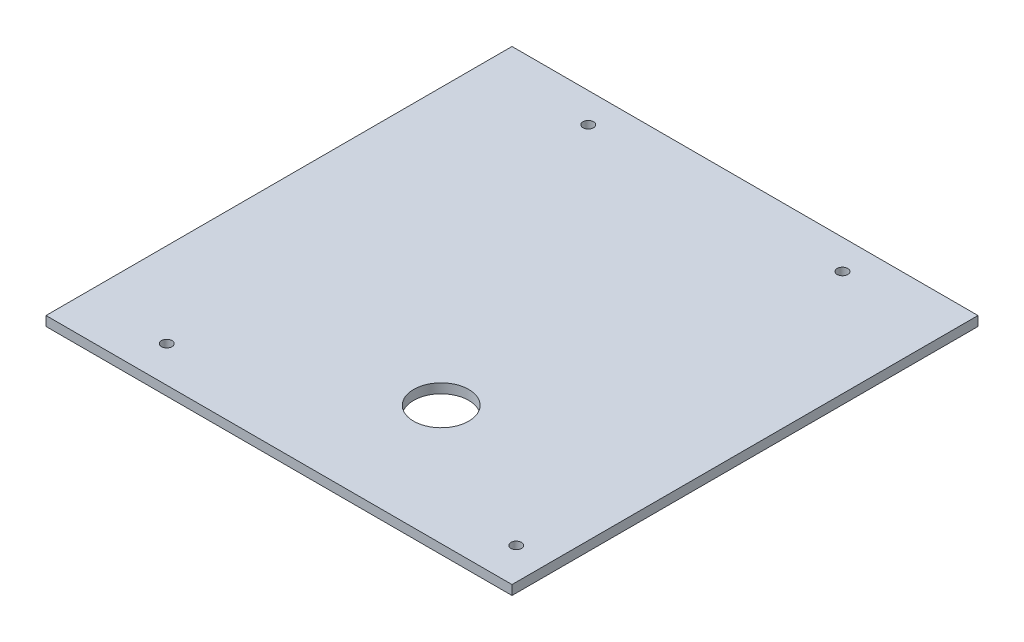
ISO-10303-21;
HEADER;
FILE_DESCRIPTION(('STEP AP214'),'2;1');
FILE_NAME('part.step','',(''),(''),'','','');
FILE_SCHEMA(('AUTOMOTIVE_DESIGN { 1 0 10303 214 1 1 1 1 }'));
ENDSEC;
DATA;
#1=APPLICATION_CONTEXT('core data for automotive mechanical design processes');
#2=APPLICATION_PROTOCOL_DEFINITION('international standard','automotive_design',2000,#1);
#3=PRODUCT_CONTEXT('',#1,'mechanical');
#4=PRODUCT('Part','Part','',(#3));
#5=PRODUCT_RELATED_PRODUCT_CATEGORY('part','',(#4));
#6=PRODUCT_DEFINITION_FORMATION('','',#4);
#7=PRODUCT_DEFINITION_CONTEXT('part definition',#1,'design');
#8=PRODUCT_DEFINITION('design','',#6,#7);
#9=PRODUCT_DEFINITION_SHAPE('','',#8);
#10=(LENGTH_UNIT() NAMED_UNIT(*) SI_UNIT(.MILLI.,.METRE.));
#11=(NAMED_UNIT(*) PLANE_ANGLE_UNIT() SI_UNIT($,.RADIAN.));
#12=(NAMED_UNIT(*) SI_UNIT($,.STERADIAN.) SOLID_ANGLE_UNIT());
#13=UNCERTAINTY_MEASURE_WITH_UNIT(LENGTH_MEASURE(1.E-05),#10,'distance_accuracy_value','');
#14=(GEOMETRIC_REPRESENTATION_CONTEXT(3) GLOBAL_UNCERTAINTY_ASSIGNED_CONTEXT((#13)) GLOBAL_UNIT_ASSIGNED_CONTEXT((#10,
#11,#12)) REPRESENTATION_CONTEXT('',''));
#15=CARTESIAN_POINT('',(0.,0.,0.));
#16=DIRECTION('',(0.,0.,1.));
#17=DIRECTION('',(1.,0.,0.));
#18=AXIS2_PLACEMENT_3D('',#15,#16,#17);
#19=CARTESIAN_POINT('',(110.,4.5,110.));
#20=DIRECTION('',(-1.,0.,0.));
#21=DIRECTION('',(0.,0.,1.));
#22=AXIS2_PLACEMENT_3D('',#19,#20,#21);
#23=PLANE('',#22);
#24=DIRECTION('',(0.,0.,-1.));
#25=VECTOR('',#24,1.);
#26=CARTESIAN_POINT('',(110.,0.,110.));
#27=LINE('',#26,#25);
#28=CARTESIAN_POINT('',(110.,0.,110.));
#29=VERTEX_POINT('',#28);
#30=CARTESIAN_POINT('',(110.,0.,-110.));
#31=VERTEX_POINT('',#30);
#32=EDGE_CURVE('E96',#29,#31,#27,.T.);
#33=ORIENTED_EDGE('',*,*,#32,.T.);
#34=DIRECTION('',(0.,-1.,0.));
#35=VECTOR('',#34,1.);
#36=CARTESIAN_POINT('',(110.,4.5,-110.));
#37=LINE('',#36,#35);
#38=CARTESIAN_POINT('',(110.,4.5,-110.));
#39=VERTEX_POINT('',#38);
#40=EDGE_CURVE('E11',#39,#31,#37,.T.);
#41=ORIENTED_EDGE('',*,*,#40,.F.);
#42=DIRECTION('',(0.,0.,-1.));
#43=VECTOR('',#42,1.);
#44=CARTESIAN_POINT('',(110.,4.5,110.));
#45=LINE('',#44,#43);
#46=CARTESIAN_POINT('',(110.,4.5,110.));
#47=VERTEX_POINT('',#46);
#48=EDGE_CURVE('E84',#47,#39,#45,.T.);
#49=ORIENTED_EDGE('',*,*,#48,.F.);
#50=DIRECTION('',(0.,-1.,0.));
#51=VECTOR('',#50,1.);
#52=CARTESIAN_POINT('',(110.,4.5,110.));
#53=LINE('',#52,#51);
#54=EDGE_CURVE('E92',#47,#29,#53,.T.);
#55=ORIENTED_EDGE('',*,*,#54,.T.);
#56=EDGE_LOOP('',(#33,#41,#49,#55));
#57=FACE_BOUND('',#56,.T.);
#58=ADVANCED_FACE('F33',(#57),#23,.F.);
#59=CARTESIAN_POINT('',(-110.,4.5,-110.));
#60=DIRECTION('',(0.,0.,1.));
#61=DIRECTION('',(1.,0.,0.));
#62=AXIS2_PLACEMENT_3D('',#59,#60,#61);
#63=PLANE('',#62);
#64=DIRECTION('',(-1.,0.,0.));
#65=VECTOR('',#64,1.);
#66=CARTESIAN_POINT('',(-110.,0.,-110.));
#67=LINE('',#66,#65);
#68=CARTESIAN_POINT('',(-110.,0.,-110.));
#69=VERTEX_POINT('',#68);
#70=EDGE_CURVE('E88',#31,#69,#67,.T.);
#71=ORIENTED_EDGE('',*,*,#70,.T.);
#72=DIRECTION('',(0.,-1.,0.));
#73=VECTOR('',#72,1.);
#74=CARTESIAN_POINT('',(-110.,4.5,-110.));
#75=LINE('',#74,#73);
#76=CARTESIAN_POINT('',(-110.,4.5,-110.));
#77=VERTEX_POINT('',#76);
#78=EDGE_CURVE('E41',#77,#69,#75,.T.);
#79=ORIENTED_EDGE('',*,*,#78,.F.);
#80=DIRECTION('',(-1.,0.,0.));
#81=VECTOR('',#80,1.);
#82=CARTESIAN_POINT('',(-110.,4.5,-110.));
#83=LINE('',#82,#81);
#84=EDGE_CURVE('E79',#39,#77,#83,.T.);
#85=ORIENTED_EDGE('',*,*,#84,.F.);
#86=ORIENTED_EDGE('',*,*,#40,.T.);
#87=EDGE_LOOP('',(#71,#79,#85,#86));
#88=FACE_BOUND('',#87,.T.);
#89=ADVANCED_FACE('F87',(#88),#63,.F.);
#90=CARTESIAN_POINT('',(-110.,4.5,110.));
#91=DIRECTION('',(1.,0.,0.));
#92=DIRECTION('',(0.,0.,-1.));
#93=AXIS2_PLACEMENT_3D('',#90,#91,#92);
#94=PLANE('',#93);
#95=DIRECTION('',(0.,0.,1.));
#96=VECTOR('',#95,1.);
#97=CARTESIAN_POINT('',(-110.,0.,110.));
#98=LINE('',#97,#96);
#99=CARTESIAN_POINT('',(-110.,0.,110.));
#100=VERTEX_POINT('',#99);
#101=EDGE_CURVE('E66',#69,#100,#98,.T.);
#102=ORIENTED_EDGE('',*,*,#101,.T.);
#103=DIRECTION('',(0.,-1.,0.));
#104=VECTOR('',#103,1.);
#105=CARTESIAN_POINT('',(-110.,4.5,110.));
#106=LINE('',#105,#104);
#107=CARTESIAN_POINT('',(-110.,4.5,110.));
#108=VERTEX_POINT('',#107);
#109=EDGE_CURVE('E89',#108,#100,#106,.T.);
#110=ORIENTED_EDGE('',*,*,#109,.F.);
#111=DIRECTION('',(0.,0.,1.));
#112=VECTOR('',#111,1.);
#113=CARTESIAN_POINT('',(-110.,4.5,110.));
#114=LINE('',#113,#112);
#115=EDGE_CURVE('E82',#77,#108,#114,.T.);
#116=ORIENTED_EDGE('',*,*,#115,.F.);
#117=ORIENTED_EDGE('',*,*,#78,.T.);
#118=EDGE_LOOP('',(#102,#110,#116,#117));
#119=FACE_BOUND('',#118,.T.);
#120=ADVANCED_FACE('F90',(#119),#94,.F.);
#121=CARTESIAN_POINT('',(-110.,4.5,110.));
#122=DIRECTION('',(0.,0.,-1.));
#123=DIRECTION('',(-1.,0.,0.));
#124=AXIS2_PLACEMENT_3D('',#121,#122,#123);
#125=PLANE('',#124);
#126=DIRECTION('',(1.,0.,0.));
#127=VECTOR('',#126,1.);
#128=CARTESIAN_POINT('',(-110.,0.,110.));
#129=LINE('',#128,#127);
#130=EDGE_CURVE('E72',#100,#29,#129,.T.);
#131=ORIENTED_EDGE('',*,*,#130,.T.);
#132=ORIENTED_EDGE('',*,*,#54,.F.);
#133=DIRECTION('',(1.,0.,0.));
#134=VECTOR('',#133,1.);
#135=CARTESIAN_POINT('',(-110.,4.5,110.));
#136=LINE('',#135,#134);
#137=EDGE_CURVE('E49',#108,#47,#136,.T.);
#138=ORIENTED_EDGE('',*,*,#137,.F.);
#139=ORIENTED_EDGE('',*,*,#109,.T.);
#140=EDGE_LOOP('',(#131,#132,#138,#139));
#141=FACE_BOUND('',#140,.T.);
#142=ADVANCED_FACE('F104',(#141),#125,.F.);
#143=CARTESIAN_POINT('',(0.,4.5,0.));
#144=DIRECTION('',(0.,-1.,0.));
#145=DIRECTION('',(0.,0.,-1.));
#146=AXIS2_PLACEMENT_3D('',#143,#144,#145);
#147=PLANE('',#146);
#148=CARTESIAN_POINT('',(-60.,4.5,-95.9999999999999));
#149=DIRECTION('',(0.,-1.,0.));
#150=DIRECTION('',(0.,0.,-1.));
#151=AXIS2_PLACEMENT_3D('',#148,#149,#150);
#152=CIRCLE('',#151,2.5);
#153=CARTESIAN_POINT('',(-60.,4.5,-98.4999999999999));
#154=VERTEX_POINT('',#153);
#155=EDGE_CURVE('E133',#154,#154,#152,.F.);
#156=ORIENTED_EDGE('',*,*,#155,.F.);
#157=EDGE_LOOP('',(#156));
#158=FACE_BOUND('',#157,.T.);
#159=CARTESIAN_POINT('',(60.,4.5,-95.9999999999999));
#160=DIRECTION('',(0.,-1.,0.));
#161=DIRECTION('',(0.,0.,-1.));
#162=AXIS2_PLACEMENT_3D('',#159,#160,#161);
#163=CIRCLE('',#162,2.5);
#164=CARTESIAN_POINT('',(60.,4.5,-98.4999999999999));
#165=VERTEX_POINT('',#164);
#166=EDGE_CURVE('E125',#165,#165,#163,.F.);
#167=ORIENTED_EDGE('',*,*,#166,.F.);
#168=EDGE_LOOP('',(#167));
#169=FACE_BOUND('',#168,.T.);
#170=CARTESIAN_POINT('',(-70.,4.5,93.));
#171=DIRECTION('',(0.,1.,0.));
#172=DIRECTION('',(0.,0.,1.));
#173=AXIS2_PLACEMENT_3D('',#170,#171,#172);
#174=CIRCLE('',#173,2.50000000000001);
#175=CARTESIAN_POINT('',(-70.,4.5,95.5));
#176=VERTEX_POINT('',#175);
#177=EDGE_CURVE('E119',#176,#176,#174,.T.);
#178=ORIENTED_EDGE('',*,*,#177,.F.);
#179=EDGE_LOOP('',(#178));
#180=FACE_BOUND('',#179,.T.);
#181=CARTESIAN_POINT('',(95.,4.5,93.));
#182=DIRECTION('',(0.,1.,0.));
#183=DIRECTION('',(0.,0.,1.));
#184=AXIS2_PLACEMENT_3D('',#181,#182,#183);
#185=CIRCLE('',#184,2.50000000000001);
#186=CARTESIAN_POINT('',(95.,4.5,95.5));
#187=VERTEX_POINT('',#186);
#188=EDGE_CURVE('E113',#187,#187,#185,.T.);
#189=ORIENTED_EDGE('',*,*,#188,.F.);
#190=EDGE_LOOP('',(#189));
#191=FACE_BOUND('',#190,.T.);
#192=CARTESIAN_POINT('',(20.,4.5,53.4314575050762));
#193=DIRECTION('',(0.,1.,0.));
#194=DIRECTION('',(0.,0.,1.));
#195=AXIS2_PLACEMENT_3D('',#192,#193,#194);
#196=CIRCLE('',#195,13.);
#197=CARTESIAN_POINT('',(20.,4.5,66.4314575050762));
#198=VERTEX_POINT('',#197);
#199=EDGE_CURVE('E99',#198,#198,#196,.T.);
#200=ORIENTED_EDGE('',*,*,#199,.F.);
#201=EDGE_LOOP('',(#200));
#202=FACE_BOUND('',#201,.T.);
#203=ORIENTED_EDGE('',*,*,#48,.T.);
#204=ORIENTED_EDGE('',*,*,#84,.T.);
#205=ORIENTED_EDGE('',*,*,#115,.T.);
#206=ORIENTED_EDGE('',*,*,#137,.T.);
#207=EDGE_LOOP('',(#203,#204,#205,#206));
#208=FACE_BOUND('',#207,.T.);
#209=ADVANCED_FACE('F80',(#158,#169,#180,#191,#202,#208),#147,.F.);
#210=CARTESIAN_POINT('',(0.,0.,0.));
#211=DIRECTION('',(0.,-1.,0.));
#212=DIRECTION('',(0.,0.,-1.));
#213=AXIS2_PLACEMENT_3D('',#210,#211,#212);
#214=PLANE('',#213);
#215=CARTESIAN_POINT('',(-60.,0.,-95.9999999999999));
#216=DIRECTION('',(0.,-1.,0.));
#217=DIRECTION('',(0.,0.,-1.));
#218=AXIS2_PLACEMENT_3D('',#215,#216,#217);
#219=CIRCLE('',#218,2.5);
#220=CARTESIAN_POINT('',(-60.,0.,-98.4999999999999));
#221=VERTEX_POINT('',#220);
#222=EDGE_CURVE('E136',#221,#221,#219,.T.);
#223=ORIENTED_EDGE('',*,*,#222,.F.);
#224=EDGE_LOOP('',(#223));
#225=FACE_BOUND('',#224,.T.);
#226=CARTESIAN_POINT('',(60.,0.,-95.9999999999999));
#227=DIRECTION('',(0.,-1.,0.));
#228=DIRECTION('',(0.,0.,-1.));
#229=AXIS2_PLACEMENT_3D('',#226,#227,#228);
#230=CIRCLE('',#229,2.5);
#231=CARTESIAN_POINT('',(60.,0.,-98.4999999999999));
#232=VERTEX_POINT('',#231);
#233=EDGE_CURVE('E130',#232,#232,#230,.T.);
#234=ORIENTED_EDGE('',*,*,#233,.F.);
#235=EDGE_LOOP('',(#234));
#236=FACE_BOUND('',#235,.T.);
#237=CARTESIAN_POINT('',(-70.,0.,93.));
#238=DIRECTION('',(0.,-1.,0.));
#239=DIRECTION('',(0.,0.,-1.));
#240=AXIS2_PLACEMENT_3D('',#237,#238,#239);
#241=CIRCLE('',#240,2.50000000000001);
#242=CARTESIAN_POINT('',(-70.,0.,90.5));
#243=VERTEX_POINT('',#242);
#244=EDGE_CURVE('E122',#243,#243,#241,.F.);
#245=ORIENTED_EDGE('',*,*,#244,.T.);
#246=EDGE_LOOP('',(#245));
#247=FACE_BOUND('',#246,.T.);
#248=CARTESIAN_POINT('',(95.,0.,93.));
#249=DIRECTION('',(0.,-1.,0.));
#250=DIRECTION('',(0.,0.,-1.));
#251=AXIS2_PLACEMENT_3D('',#248,#249,#250);
#252=CIRCLE('',#251,2.50000000000001);
#253=CARTESIAN_POINT('',(95.,0.,90.5));
#254=VERTEX_POINT('',#253);
#255=EDGE_CURVE('E116',#254,#254,#252,.F.);
#256=ORIENTED_EDGE('',*,*,#255,.T.);
#257=EDGE_LOOP('',(#256));
#258=FACE_BOUND('',#257,.T.);
#259=CARTESIAN_POINT('',(20.,0.,53.4314575050762));
#260=DIRECTION('',(0.,-1.,0.));
#261=DIRECTION('',(0.,0.,-1.));
#262=AXIS2_PLACEMENT_3D('',#259,#260,#261);
#263=CIRCLE('',#262,13.);
#264=CARTESIAN_POINT('',(20.,0.,40.4314575050762));
#265=VERTEX_POINT('',#264);
#266=EDGE_CURVE('E110',#265,#265,#263,.F.);
#267=ORIENTED_EDGE('',*,*,#266,.T.);
#268=EDGE_LOOP('',(#267));
#269=FACE_BOUND('',#268,.T.);
#270=ORIENTED_EDGE('',*,*,#32,.F.);
#271=ORIENTED_EDGE('',*,*,#130,.F.);
#272=ORIENTED_EDGE('',*,*,#101,.F.);
#273=ORIENTED_EDGE('',*,*,#70,.F.);
#274=EDGE_LOOP('',(#270,#271,#272,#273));
#275=FACE_BOUND('',#274,.T.);
#276=ADVANCED_FACE('F107',(#225,#236,#247,#258,#269,#275),#214,.T.);
#277=CARTESIAN_POINT('',(20.,-0.00100000000000013,53.4314575050762));
#278=DIRECTION('',(0.,1.,0.));
#279=DIRECTION('',(0.,0.,1.));
#280=AXIS2_PLACEMENT_3D('',#277,#278,#279);
#281=CYLINDRICAL_SURFACE('',#280,13.);
#282=ORIENTED_EDGE('',*,*,#266,.F.);
#283=EDGE_LOOP('',(#282));
#284=FACE_BOUND('',#283,.T.);
#285=ORIENTED_EDGE('',*,*,#199,.T.);
#286=EDGE_LOOP('',(#285));
#287=FACE_BOUND('',#286,.T.);
#288=ADVANCED_FACE('F145',(#284,#287),#281,.F.);
#289=CARTESIAN_POINT('',(95.,-0.00100000000000013,93.));
#290=DIRECTION('',(0.,1.,0.));
#291=DIRECTION('',(0.,0.,1.));
#292=AXIS2_PLACEMENT_3D('',#289,#290,#291);
#293=CYLINDRICAL_SURFACE('',#292,2.50000000000001);
#294=ORIENTED_EDGE('',*,*,#255,.F.);
#295=EDGE_LOOP('',(#294));
#296=FACE_BOUND('',#295,.T.);
#297=ORIENTED_EDGE('',*,*,#188,.T.);
#298=EDGE_LOOP('',(#297));
#299=FACE_BOUND('',#298,.T.);
#300=ADVANCED_FACE('F157',(#296,#299),#293,.F.);
#301=CARTESIAN_POINT('',(-70.,-0.00100000000000013,93.));
#302=DIRECTION('',(0.,1.,0.));
#303=DIRECTION('',(0.,0.,1.));
#304=AXIS2_PLACEMENT_3D('',#301,#302,#303);
#305=CYLINDRICAL_SURFACE('',#304,2.50000000000001);
#306=ORIENTED_EDGE('',*,*,#244,.F.);
#307=EDGE_LOOP('',(#306));
#308=FACE_BOUND('',#307,.T.);
#309=ORIENTED_EDGE('',*,*,#177,.T.);
#310=EDGE_LOOP('',(#309));
#311=FACE_BOUND('',#310,.T.);
#312=ADVANCED_FACE('F201',(#308,#311),#305,.F.);
#313=CARTESIAN_POINT('',(60.,4.501,-95.9999999999999));
#314=DIRECTION('',(0.,-1.,0.));
#315=DIRECTION('',(0.,0.,-1.));
#316=AXIS2_PLACEMENT_3D('',#313,#314,#315);
#317=CYLINDRICAL_SURFACE('',#316,2.5);
#318=ORIENTED_EDGE('',*,*,#233,.T.);
#319=EDGE_LOOP('',(#318));
#320=FACE_BOUND('',#319,.T.);
#321=ORIENTED_EDGE('',*,*,#166,.T.);
#322=EDGE_LOOP('',(#321));
#323=FACE_BOUND('',#322,.T.);
#324=ADVANCED_FACE('F210',(#320,#323),#317,.F.);
#325=CARTESIAN_POINT('',(-60.,4.501,-95.9999999999999));
#326=DIRECTION('',(0.,-1.,0.));
#327=DIRECTION('',(0.,0.,-1.));
#328=AXIS2_PLACEMENT_3D('',#325,#326,#327);
#329=CYLINDRICAL_SURFACE('',#328,2.5);
#330=ORIENTED_EDGE('',*,*,#222,.T.);
#331=EDGE_LOOP('',(#330));
#332=FACE_BOUND('',#331,.T.);
#333=ORIENTED_EDGE('',*,*,#155,.T.);
#334=EDGE_LOOP('',(#333));
#335=FACE_BOUND('',#334,.T.);
#336=ADVANCED_FACE('F140',(#332,#335),#329,.F.);
#337=CLOSED_SHELL('',(#58,#89,#120,#142,#209,#276,#288,#300,#312,#324,#336));
#338=MANIFOLD_SOLID_BREP('B2',#337);
#339=ADVANCED_BREP_SHAPE_REPRESENTATION('',(#18,#338),#14);
#340=SHAPE_DEFINITION_REPRESENTATION(#9,#339);
ENDSEC;
END-ISO-10303-21;
